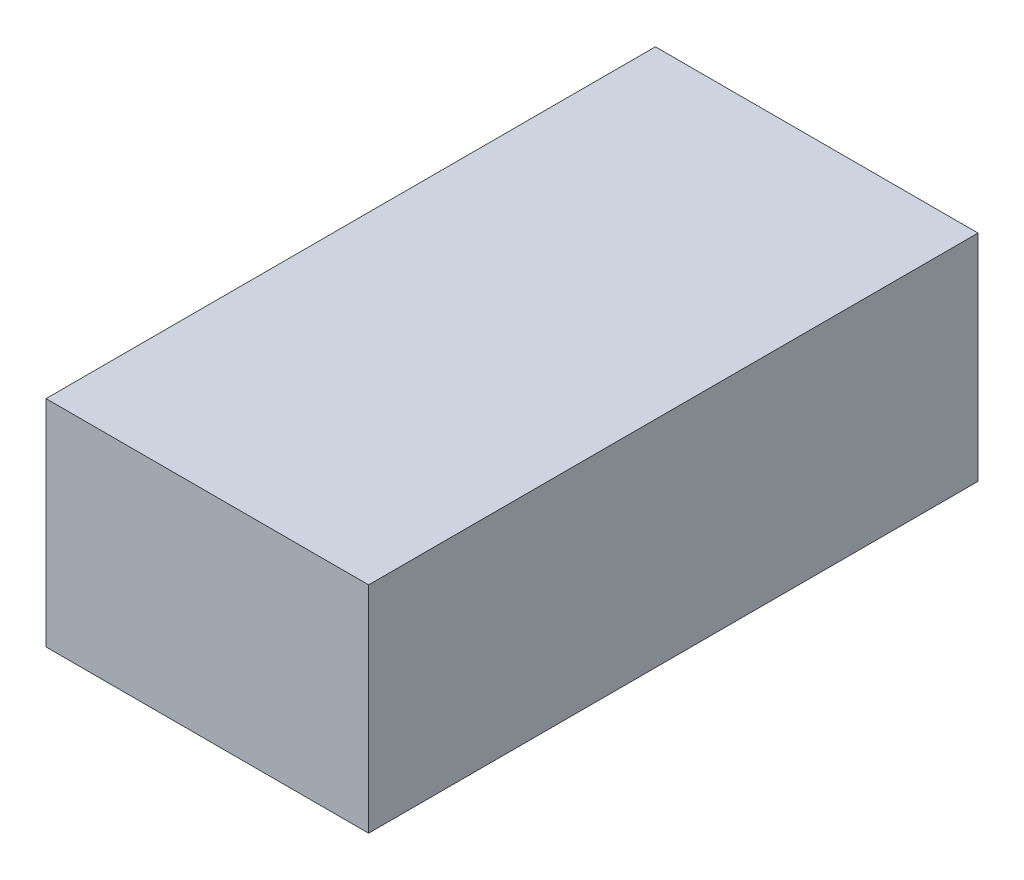
ISO-10303-21;
HEADER;
FILE_DESCRIPTION(('STEP AP214'),'2;1');
FILE_NAME('part.step','',(''),(''),'','','');
FILE_SCHEMA(('AUTOMOTIVE_DESIGN { 1 0 10303 214 1 1 1 1 }'));
ENDSEC;
DATA;
#1=APPLICATION_CONTEXT('core data for automotive mechanical design processes');
#2=APPLICATION_PROTOCOL_DEFINITION('international standard','automotive_design',2000,#1);
#3=PRODUCT_CONTEXT('',#1,'mechanical');
#4=PRODUCT('Part','Part','',(#3));
#5=PRODUCT_RELATED_PRODUCT_CATEGORY('part','',(#4));
#6=PRODUCT_DEFINITION_FORMATION('','',#4);
#7=PRODUCT_DEFINITION_CONTEXT('part definition',#1,'design');
#8=PRODUCT_DEFINITION('design','',#6,#7);
#9=PRODUCT_DEFINITION_SHAPE('','',#8);
#10=(LENGTH_UNIT() NAMED_UNIT(*) SI_UNIT(.MILLI.,.METRE.));
#11=(NAMED_UNIT(*) PLANE_ANGLE_UNIT() SI_UNIT($,.RADIAN.));
#12=(NAMED_UNIT(*) SI_UNIT($,.STERADIAN.) SOLID_ANGLE_UNIT());
#13=UNCERTAINTY_MEASURE_WITH_UNIT(LENGTH_MEASURE(1.E-05),#10,'distance_accuracy_value','');
#14=(GEOMETRIC_REPRESENTATION_CONTEXT(3) GLOBAL_UNCERTAINTY_ASSIGNED_CONTEXT((#13)) GLOBAL_UNIT_ASSIGNED_CONTEXT((#10,
#11,#12)) REPRESENTATION_CONTEXT('',''));
#15=CARTESIAN_POINT('',(0.,0.,0.));
#16=DIRECTION('',(0.,0.,1.));
#17=DIRECTION('',(1.,0.,0.));
#18=AXIS2_PLACEMENT_3D('',#15,#16,#17);
#19=CARTESIAN_POINT('',(-22.5,30.,42.5));
#20=DIRECTION('',(1.,0.,0.));
#21=DIRECTION('',(0.,0.,-1.));
#22=AXIS2_PLACEMENT_3D('',#19,#20,#21);
#23=PLANE('',#22);
#24=DIRECTION('',(0.,0.,1.));
#25=VECTOR('',#24,1.);
#26=CARTESIAN_POINT('',(-22.5,0.,42.5));
#27=LINE('',#26,#25);
#28=CARTESIAN_POINT('',(-22.5,0.,-42.5));
#29=VERTEX_POINT('',#28);
#30=CARTESIAN_POINT('',(-22.5,0.,42.5));
#31=VERTEX_POINT('',#30);
#32=EDGE_CURVE('E96',#29,#31,#27,.T.);
#33=ORIENTED_EDGE('',*,*,#32,.T.);
#34=DIRECTION('',(0.,-1.,0.));
#35=VECTOR('',#34,1.);
#36=CARTESIAN_POINT('',(-22.5,30.,42.5));
#37=LINE('',#36,#35);
#38=CARTESIAN_POINT('',(-22.5,30.,42.5));
#39=VERTEX_POINT('',#38);
#40=EDGE_CURVE('E11',#39,#31,#37,.T.);
#41=ORIENTED_EDGE('',*,*,#40,.F.);
#42=DIRECTION('',(0.,0.,1.));
#43=VECTOR('',#42,1.);
#44=CARTESIAN_POINT('',(-22.5,30.,42.5));
#45=LINE('',#44,#43);
#46=CARTESIAN_POINT('',(-22.5,30.,-42.5));
#47=VERTEX_POINT('',#46);
#48=EDGE_CURVE('E84',#47,#39,#45,.T.);
#49=ORIENTED_EDGE('',*,*,#48,.F.);
#50=DIRECTION('',(0.,-1.,0.));
#51=VECTOR('',#50,1.);
#52=CARTESIAN_POINT('',(-22.5,30.,-42.5));
#53=LINE('',#52,#51);
#54=EDGE_CURVE('E92',#47,#29,#53,.T.);
#55=ORIENTED_EDGE('',*,*,#54,.T.);
#56=EDGE_LOOP('',(#33,#41,#49,#55));
#57=FACE_BOUND('',#56,.T.);
#58=ADVANCED_FACE('F33',(#57),#23,.F.);
#59=CARTESIAN_POINT('',(22.5,30.,42.5));
#60=DIRECTION('',(0.,0.,-1.));
#61=DIRECTION('',(-1.,0.,0.));
#62=AXIS2_PLACEMENT_3D('',#59,#60,#61);
#63=PLANE('',#62);
#64=DIRECTION('',(1.,0.,0.));
#65=VECTOR('',#64,1.);
#66=CARTESIAN_POINT('',(22.5,0.,42.5));
#67=LINE('',#66,#65);
#68=CARTESIAN_POINT('',(22.5,0.,42.5));
#69=VERTEX_POINT('',#68);
#70=EDGE_CURVE('E88',#31,#69,#67,.T.);
#71=ORIENTED_EDGE('',*,*,#70,.T.);
#72=DIRECTION('',(0.,-1.,0.));
#73=VECTOR('',#72,1.);
#74=CARTESIAN_POINT('',(22.5,30.,42.5));
#75=LINE('',#74,#73);
#76=CARTESIAN_POINT('',(22.5,30.,42.5));
#77=VERTEX_POINT('',#76);
#78=EDGE_CURVE('E41',#77,#69,#75,.T.);
#79=ORIENTED_EDGE('',*,*,#78,.F.);
#80=DIRECTION('',(1.,0.,0.));
#81=VECTOR('',#80,1.);
#82=CARTESIAN_POINT('',(22.5,30.,42.5));
#83=LINE('',#82,#81);
#84=EDGE_CURVE('E79',#39,#77,#83,.T.);
#85=ORIENTED_EDGE('',*,*,#84,.F.);
#86=ORIENTED_EDGE('',*,*,#40,.T.);
#87=EDGE_LOOP('',(#71,#79,#85,#86));
#88=FACE_BOUND('',#87,.T.);
#89=ADVANCED_FACE('F87',(#88),#63,.F.);
#90=CARTESIAN_POINT('',(22.5,30.,42.5));
#91=DIRECTION('',(-1.,0.,0.));
#92=DIRECTION('',(0.,0.,1.));
#93=AXIS2_PLACEMENT_3D('',#90,#91,#92);
#94=PLANE('',#93);
#95=DIRECTION('',(0.,0.,-1.));
#96=VECTOR('',#95,1.);
#97=CARTESIAN_POINT('',(22.5,0.,42.5));
#98=LINE('',#97,#96);
#99=CARTESIAN_POINT('',(22.5,0.,-42.5));
#100=VERTEX_POINT('',#99);
#101=EDGE_CURVE('E66',#69,#100,#98,.T.);
#102=ORIENTED_EDGE('',*,*,#101,.T.);
#103=DIRECTION('',(0.,-1.,0.));
#104=VECTOR('',#103,1.);
#105=CARTESIAN_POINT('',(22.5,30.,-42.5));
#106=LINE('',#105,#104);
#107=CARTESIAN_POINT('',(22.5,30.,-42.5));
#108=VERTEX_POINT('',#107);
#109=EDGE_CURVE('E89',#108,#100,#106,.T.);
#110=ORIENTED_EDGE('',*,*,#109,.F.);
#111=DIRECTION('',(0.,0.,-1.));
#112=VECTOR('',#111,1.);
#113=CARTESIAN_POINT('',(22.5,30.,42.5));
#114=LINE('',#113,#112);
#115=EDGE_CURVE('E82',#77,#108,#114,.T.);
#116=ORIENTED_EDGE('',*,*,#115,.F.);
#117=ORIENTED_EDGE('',*,*,#78,.T.);
#118=EDGE_LOOP('',(#102,#110,#116,#117));
#119=FACE_BOUND('',#118,.T.);
#120=ADVANCED_FACE('F90',(#119),#94,.F.);
#121=CARTESIAN_POINT('',(22.5,30.,-42.5));
#122=DIRECTION('',(0.,0.,1.));
#123=DIRECTION('',(1.,0.,0.));
#124=AXIS2_PLACEMENT_3D('',#121,#122,#123);
#125=PLANE('',#124);
#126=DIRECTION('',(-1.,0.,0.));
#127=VECTOR('',#126,1.);
#128=CARTESIAN_POINT('',(22.5,0.,-42.5));
#129=LINE('',#128,#127);
#130=EDGE_CURVE('E72',#100,#29,#129,.T.);
#131=ORIENTED_EDGE('',*,*,#130,.T.);
#132=ORIENTED_EDGE('',*,*,#54,.F.);
#133=DIRECTION('',(-1.,0.,0.));
#134=VECTOR('',#133,1.);
#135=CARTESIAN_POINT('',(22.5,30.,-42.5));
#136=LINE('',#135,#134);
#137=EDGE_CURVE('E49',#108,#47,#136,.T.);
#138=ORIENTED_EDGE('',*,*,#137,.F.);
#139=ORIENTED_EDGE('',*,*,#109,.T.);
#140=EDGE_LOOP('',(#131,#132,#138,#139));
#141=FACE_BOUND('',#140,.T.);
#142=ADVANCED_FACE('F103',(#141),#125,.F.);
#143=CARTESIAN_POINT('',(0.,30.,0.));
#144=DIRECTION('',(0.,1.,0.));
#145=DIRECTION('',(0.,0.,1.));
#146=AXIS2_PLACEMENT_3D('',#143,#144,#145);
#147=PLANE('',#146);
#148=ORIENTED_EDGE('',*,*,#48,.T.);
#149=ORIENTED_EDGE('',*,*,#84,.T.);
#150=ORIENTED_EDGE('',*,*,#115,.T.);
#151=ORIENTED_EDGE('',*,*,#137,.T.);
#152=EDGE_LOOP('',(#148,#149,#150,#151));
#153=FACE_BOUND('',#152,.T.);
#154=ADVANCED_FACE('F80',(#153),#147,.T.);
#155=CARTESIAN_POINT('',(0.,0.,0.));
#156=DIRECTION('',(0.,1.,0.));
#157=DIRECTION('',(0.,0.,1.));
#158=AXIS2_PLACEMENT_3D('',#155,#156,#157);
#159=PLANE('',#158);
#160=ORIENTED_EDGE('',*,*,#32,.F.);
#161=ORIENTED_EDGE('',*,*,#130,.F.);
#162=ORIENTED_EDGE('',*,*,#101,.F.);
#163=ORIENTED_EDGE('',*,*,#70,.F.);
#164=EDGE_LOOP('',(#160,#161,#162,#163));
#165=FACE_BOUND('',#164,.T.);
#166=ADVANCED_FACE('F106',(#165),#159,.F.);
#167=CLOSED_SHELL('',(#58,#89,#120,#142,#154,#166));
#168=MANIFOLD_SOLID_BREP('B2',#167);
#169=ADVANCED_BREP_SHAPE_REPRESENTATION('',(#18,#168),#14);
#170=SHAPE_DEFINITION_REPRESENTATION(#9,#169);
ENDSEC;
END-ISO-10303-21;
